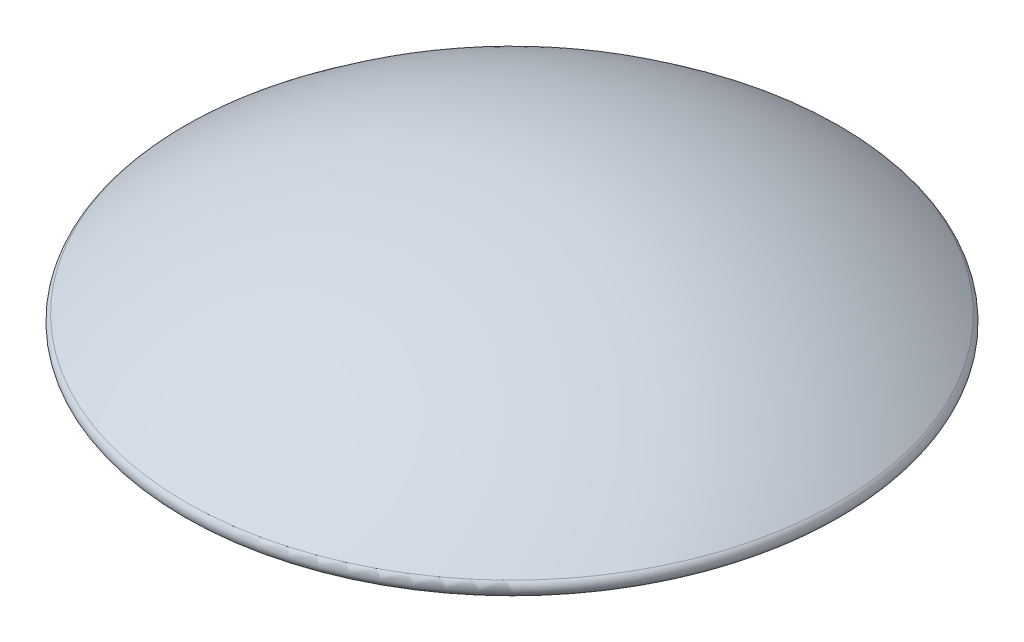
ISO-10303-21;
HEADER;
FILE_DESCRIPTION(('STEP AP214'),'2;1');
FILE_NAME('part.step','',(''),(''),'','','');
FILE_SCHEMA(('AUTOMOTIVE_DESIGN { 1 0 10303 214 1 1 1 1 }'));
ENDSEC;
DATA;
#1=APPLICATION_CONTEXT('core data for automotive mechanical design processes');
#2=APPLICATION_PROTOCOL_DEFINITION('international standard','automotive_design',2000,#1);
#3=PRODUCT_CONTEXT('',#1,'mechanical');
#4=PRODUCT('Part','Part','',(#3));
#5=PRODUCT_RELATED_PRODUCT_CATEGORY('part','',(#4));
#6=PRODUCT_DEFINITION_FORMATION('','',#4);
#7=PRODUCT_DEFINITION_CONTEXT('part definition',#1,'design');
#8=PRODUCT_DEFINITION('design','',#6,#7);
#9=PRODUCT_DEFINITION_SHAPE('','',#8);
#10=(LENGTH_UNIT() NAMED_UNIT(*) SI_UNIT(.MILLI.,.METRE.));
#11=(NAMED_UNIT(*) PLANE_ANGLE_UNIT() SI_UNIT($,.RADIAN.));
#12=(NAMED_UNIT(*) SI_UNIT($,.STERADIAN.) SOLID_ANGLE_UNIT());
#13=UNCERTAINTY_MEASURE_WITH_UNIT(LENGTH_MEASURE(1.E-05),#10,'distance_accuracy_value','');
#14=(GEOMETRIC_REPRESENTATION_CONTEXT(3) GLOBAL_UNCERTAINTY_ASSIGNED_CONTEXT((#13)) GLOBAL_UNIT_ASSIGNED_CONTEXT((#10,
#11,#12)) REPRESENTATION_CONTEXT('',''));
#15=CARTESIAN_POINT('',(0.,0.,0.));
#16=DIRECTION('',(0.,0.,1.));
#17=DIRECTION('',(1.,0.,0.));
#18=AXIS2_PLACEMENT_3D('',#15,#16,#17);
#19=CARTESIAN_POINT('',(0.,-9.16666666666667,0.));
#20=DIRECTION('',(0.,1.,0.));
#21=DIRECTION('',(0.,0.,1.));
#22=AXIS2_PLACEMENT_3D('',#19,#20,#21);
#23=SPHERICAL_SURFACE('',#22,12.1666666666667);
#24=CARTESIAN_POINT('',(0.,0.356545961002784,0.));
#25=DIRECTION('',(0.,-1.,0.));
#26=DIRECTION('',(0.,0.,-1.));
#27=AXIS2_PLACEMENT_3D('',#24,#25,#26);
#28=CIRCLE('',#27,7.57206702466208);
#29=CARTESIAN_POINT('',(0.,0.356545961002784,-7.57206702466208));
#30=VERTEX_POINT('',#29);
#31=EDGE_CURVE('E72',#30,#30,#28,.F.);
#32=ORIENTED_EDGE('',*,*,#31,.T.);
#33=EDGE_LOOP('',(#32));
#34=FACE_BOUND('',#33,.T.);
#35=ADVANCED_FACE('F37',(#34),#23,.T.);
#36=CARTESIAN_POINT('',(0.,0.,4.));
#37=DIRECTION('',(0.,-1.,0.));
#38=DIRECTION('',(0.,0.,-1.));
#39=AXIS2_PLACEMENT_3D('',#36,#37,#38);
#40=PLANE('',#39);
#41=CARTESIAN_POINT('',(0.,0.,0.));
#42=DIRECTION('',(0.,-1.,0.));
#43=DIRECTION('',(0.,0.,-1.));
#44=AXIS2_PLACEMENT_3D('',#41,#42,#43);
#45=CIRCLE('',#44,3.8);
#46=CARTESIAN_POINT('',(0.,0.,-3.8));
#47=VERTEX_POINT('',#46);
#48=EDGE_CURVE('E48',#47,#47,#45,.T.);
#49=ORIENTED_EDGE('',*,*,#48,.T.);
#50=EDGE_LOOP('',(#49));
#51=FACE_BOUND('',#50,.T.);
#52=ADVANCED_FACE('F96',(#51),#40,.T.);
#53=CARTESIAN_POINT('',(0.,12.065472465582,0.));
#54=DIRECTION('',(0.,1.,0.));
#55=DIRECTION('',(0.,0.,1.));
#56=AXIS2_PLACEMENT_3D('',#53,#54,#55);
#57=CYLINDRICAL_SURFACE('',#56,4.);
#58=CARTESIAN_POINT('',(0.,-0.200000000000002,0.));
#59=DIRECTION('',(0.,-1.,0.));
#60=DIRECTION('',(0.,0.,-1.));
#61=AXIS2_PLACEMENT_3D('',#58,#59,#60);
#62=CIRCLE('',#61,4.);
#63=CARTESIAN_POINT('',(0.,-0.200000000000002,-4.));
#64=VERTEX_POINT('',#63);
#65=EDGE_CURVE('E52',#64,#64,#62,.F.);
#66=ORIENTED_EDGE('',*,*,#65,.T.);
#67=EDGE_LOOP('',(#66));
#68=FACE_BOUND('',#67,.T.);
#69=CARTESIAN_POINT('',(0.,-0.800000000000002,0.));
#70=DIRECTION('',(0.,-1.,0.));
#71=DIRECTION('',(0.,0.,-1.));
#72=AXIS2_PLACEMENT_3D('',#69,#70,#71);
#73=CIRCLE('',#72,4.);
#74=CARTESIAN_POINT('',(0.,-0.800000000000002,-4.));
#75=VERTEX_POINT('',#74);
#76=EDGE_CURVE('E57',#75,#75,#73,.T.);
#77=ORIENTED_EDGE('',*,*,#76,.T.);
#78=EDGE_LOOP('',(#77));
#79=FACE_BOUND('',#78,.T.);
#80=ADVANCED_FACE('F100',(#68,#79),#57,.F.);
#81=CARTESIAN_POINT('',(0.,-1.,5.));
#82=DIRECTION('',(0.,-1.,0.));
#83=DIRECTION('',(0.,0.,-1.));
#84=AXIS2_PLACEMENT_3D('',#81,#82,#83);
#85=PLANE('',#84);
#86=CARTESIAN_POINT('',(0.,-1.,0.));
#87=DIRECTION('',(0.,-1.,0.));
#88=DIRECTION('',(0.,0.,-1.));
#89=AXIS2_PLACEMENT_3D('',#86,#87,#88);
#90=CIRCLE('',#89,4.8);
#91=CARTESIAN_POINT('',(0.,-1.,-4.8));
#92=VERTEX_POINT('',#91);
#93=EDGE_CURVE('E10',#92,#92,#90,.T.);
#94=ORIENTED_EDGE('',*,*,#93,.T.);
#95=EDGE_LOOP('',(#94));
#96=FACE_BOUND('',#95,.T.);
#97=CARTESIAN_POINT('',(0.,-1.,0.));
#98=DIRECTION('',(0.,-1.,0.));
#99=DIRECTION('',(0.,0.,-1.));
#100=AXIS2_PLACEMENT_3D('',#97,#98,#99);
#101=CIRCLE('',#100,4.2);
#102=CARTESIAN_POINT('',(0.,-1.,-4.2));
#103=VERTEX_POINT('',#102);
#104=EDGE_CURVE('E44',#103,#103,#101,.F.);
#105=ORIENTED_EDGE('',*,*,#104,.T.);
#106=EDGE_LOOP('',(#105));
#107=FACE_BOUND('',#106,.T.);
#108=ADVANCED_FACE('F106',(#96,#107),#85,.T.);
#109=CARTESIAN_POINT('',(0.,12.065472465582,0.));
#110=DIRECTION('',(0.,1.,0.));
#111=DIRECTION('',(0.,0.,1.));
#112=AXIS2_PLACEMENT_3D('',#109,#110,#111);
#113=CYLINDRICAL_SURFACE('',#112,5.);
#114=CARTESIAN_POINT('',(0.,-0.199999999999999,0.));
#115=DIRECTION('',(0.,-1.,0.));
#116=DIRECTION('',(0.,0.,-1.));
#117=AXIS2_PLACEMENT_3D('',#114,#115,#116);
#118=CIRCLE('',#117,5.);
#119=CARTESIAN_POINT('',(0.,-0.199999999999999,-5.));
#120=VERTEX_POINT('',#119);
#121=EDGE_CURVE('E60',#120,#120,#118,.T.);
#122=ORIENTED_EDGE('',*,*,#121,.T.);
#123=EDGE_LOOP('',(#122));
#124=FACE_BOUND('',#123,.T.);
#125=CARTESIAN_POINT('',(0.,-0.799999999999999,0.));
#126=DIRECTION('',(0.,-1.,0.));
#127=DIRECTION('',(0.,0.,-1.));
#128=AXIS2_PLACEMENT_3D('',#125,#126,#127);
#129=CIRCLE('',#128,5.);
#130=CARTESIAN_POINT('',(0.,-0.799999999999999,-5.));
#131=VERTEX_POINT('',#130);
#132=EDGE_CURVE('E63',#131,#131,#129,.F.);
#133=ORIENTED_EDGE('',*,*,#132,.T.);
#134=EDGE_LOOP('',(#133));
#135=FACE_BOUND('',#134,.T.);
#136=ADVANCED_FACE('F90',(#124,#135),#113,.T.);
#137=CARTESIAN_POINT('',(0.,0.,8.));
#138=DIRECTION('',(0.,-1.,0.));
#139=DIRECTION('',(0.,0.,-1.));
#140=AXIS2_PLACEMENT_3D('',#137,#138,#139);
#141=PLANE('',#140);
#142=CARTESIAN_POINT('',(0.,0.,0.));
#143=DIRECTION('',(0.,-1.,0.));
#144=DIRECTION('',(0.,0.,-1.));
#145=AXIS2_PLACEMENT_3D('',#142,#143,#144);
#146=CIRCLE('',#145,5.2);
#147=CARTESIAN_POINT('',(0.,0.,-5.2));
#148=VERTEX_POINT('',#147);
#149=EDGE_CURVE('E66',#148,#148,#146,.F.);
#150=ORIENTED_EDGE('',*,*,#149,.T.);
#151=EDGE_LOOP('',(#150));
#152=FACE_BOUND('',#151,.T.);
#153=CARTESIAN_POINT('',(0.,0.,0.));
#154=DIRECTION('',(0.,-1.,0.));
#155=DIRECTION('',(0.,0.,-1.));
#156=AXIS2_PLACEMENT_3D('',#153,#154,#155);
#157=CIRCLE('',#156,7.4475946900101);
#158=CARTESIAN_POINT('',(0.,0.,-7.4475946900101));
#159=VERTEX_POINT('',#158);
#160=EDGE_CURVE('E69',#159,#159,#157,.T.);
#161=ORIENTED_EDGE('',*,*,#160,.T.);
#162=EDGE_LOOP('',(#161));
#163=FACE_BOUND('',#162,.T.);
#164=ADVANCED_FACE('F80',(#152,#163),#141,.T.);
#165=CARTESIAN_POINT('',(0.,0.200000000000001,0.));
#166=DIRECTION('',(0.,-1.,0.));
#167=DIRECTION('',(0.,0.,-1.));
#168=AXIS2_PLACEMENT_3D('',#165,#166,#167);
#169=TOROIDAL_SURFACE('',#168,7.4475946900101,0.2);
#170=ORIENTED_EDGE('',*,*,#160,.F.);
#171=EDGE_LOOP('',(#170));
#172=FACE_BOUND('',#171,.T.);
#173=ORIENTED_EDGE('',*,*,#31,.F.);
#174=EDGE_LOOP('',(#173));
#175=FACE_BOUND('',#174,.T.);
#176=ADVANCED_FACE('F77',(#172,#175),#169,.T.);
#177=CARTESIAN_POINT('',(0.,0.,0.));
#178=DIRECTION('',(0.,1.,0.));
#179=DIRECTION('',(0.,0.,1.));
#180=AXIS2_PLACEMENT_3D('',#177,#178,#179);
#181=CONICAL_SURFACE('',#180,5.2,0.785398163397457);
#182=ORIENTED_EDGE('',*,*,#121,.F.);
#183=EDGE_LOOP('',(#182));
#184=FACE_BOUND('',#183,.T.);
#185=ORIENTED_EDGE('',*,*,#149,.F.);
#186=EDGE_LOOP('',(#185));
#187=FACE_BOUND('',#186,.T.);
#188=ADVANCED_FACE('F79',(#184,#187),#181,.T.);
#189=CARTESIAN_POINT('',(0.,-0.200000000000002,0.));
#190=DIRECTION('',(0.,-1.,0.));
#191=DIRECTION('',(0.,0.,-1.));
#192=AXIS2_PLACEMENT_3D('',#189,#190,#191);
#193=CONICAL_SURFACE('',#192,4.,0.785398163397444);
#194=ORIENTED_EDGE('',*,*,#48,.F.);
#195=EDGE_LOOP('',(#194));
#196=FACE_BOUND('',#195,.T.);
#197=ORIENTED_EDGE('',*,*,#65,.F.);
#198=EDGE_LOOP('',(#197));
#199=FACE_BOUND('',#198,.T.);
#200=ADVANCED_FACE('F87',(#196,#199),#193,.F.);
#201=CARTESIAN_POINT('',(0.,-0.799999999999999,0.));
#202=DIRECTION('',(0.,1.,0.));
#203=DIRECTION('',(0.,0.,1.));
#204=AXIS2_PLACEMENT_3D('',#201,#202,#203);
#205=CONICAL_SURFACE('',#204,5.,0.785398163397448);
#206=ORIENTED_EDGE('',*,*,#93,.F.);
#207=EDGE_LOOP('',(#206));
#208=FACE_BOUND('',#207,.T.);
#209=ORIENTED_EDGE('',*,*,#132,.F.);
#210=EDGE_LOOP('',(#209));
#211=FACE_BOUND('',#210,.T.);
#212=ADVANCED_FACE('F118',(#208,#211),#205,.T.);
#213=CARTESIAN_POINT('',(0.,-1.,0.));
#214=DIRECTION('',(0.,-1.,0.));
#215=DIRECTION('',(0.,0.,-1.));
#216=AXIS2_PLACEMENT_3D('',#213,#214,#215);
#217=CONICAL_SURFACE('',#216,4.2,0.785398163397448);
#218=ORIENTED_EDGE('',*,*,#76,.F.);
#219=EDGE_LOOP('',(#218));
#220=FACE_BOUND('',#219,.T.);
#221=ORIENTED_EDGE('',*,*,#104,.F.);
#222=EDGE_LOOP('',(#221));
#223=FACE_BOUND('',#222,.T.);
#224=ADVANCED_FACE('F39',(#220,#223),#217,.F.);
#225=CLOSED_SHELL('',(#35,#52,#80,#108,#136,#164,#176,#188,#200,#212,#224));
#226=MANIFOLD_SOLID_BREP('B2',#225);
#227=ADVANCED_BREP_SHAPE_REPRESENTATION('',(#18,#226),#14);
#228=SHAPE_DEFINITION_REPRESENTATION(#9,#227);
ENDSEC;
END-ISO-10303-21;
